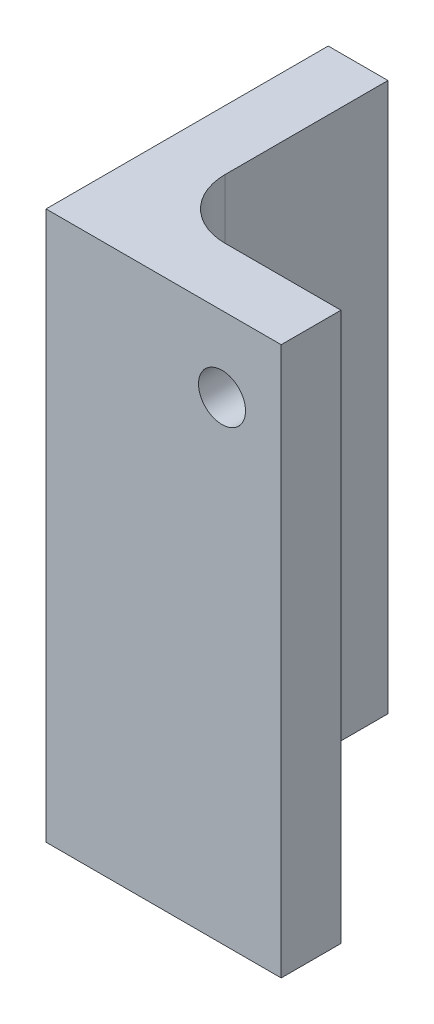
ISO-10303-21;
HEADER;
FILE_DESCRIPTION(('STEP AP214'),'2;1');
FILE_NAME('part.step','',(''),(''),'','','');
FILE_SCHEMA(('AUTOMOTIVE_DESIGN { 1 0 10303 214 1 1 1 1 }'));
ENDSEC;
DATA;
#1=APPLICATION_CONTEXT('core data for automotive mechanical design processes');
#2=APPLICATION_PROTOCOL_DEFINITION('international standard','automotive_design',2000,#1);
#3=PRODUCT_CONTEXT('',#1,'mechanical');
#4=PRODUCT('Part','Part','',(#3));
#5=PRODUCT_RELATED_PRODUCT_CATEGORY('part','',(#4));
#6=PRODUCT_DEFINITION_FORMATION('','',#4);
#7=PRODUCT_DEFINITION_CONTEXT('part definition',#1,'design');
#8=PRODUCT_DEFINITION('design','',#6,#7);
#9=PRODUCT_DEFINITION_SHAPE('','',#8);
#10=(LENGTH_UNIT() NAMED_UNIT(*) SI_UNIT(.MILLI.,.METRE.));
#11=(NAMED_UNIT(*) PLANE_ANGLE_UNIT() SI_UNIT($,.RADIAN.));
#12=(NAMED_UNIT(*) SI_UNIT($,.STERADIAN.) SOLID_ANGLE_UNIT());
#13=UNCERTAINTY_MEASURE_WITH_UNIT(LENGTH_MEASURE(1.E-05),#10,'distance_accuracy_value','');
#14=(GEOMETRIC_REPRESENTATION_CONTEXT(3) GLOBAL_UNCERTAINTY_ASSIGNED_CONTEXT((#13)) GLOBAL_UNIT_ASSIGNED_CONTEXT((#10,
#11,#12)) REPRESENTATION_CONTEXT('',''));
#15=CARTESIAN_POINT('',(0.,0.,0.));
#16=DIRECTION('',(0.,0.,1.));
#17=DIRECTION('',(1.,0.,0.));
#18=AXIS2_PLACEMENT_3D('',#15,#16,#17);
#19=CARTESIAN_POINT('',(6.35,58.31,0.));
#20=DIRECTION('',(-1.,0.,0.));
#21=DIRECTION('',(0.,0.,1.));
#22=AXIS2_PLACEMENT_3D('',#19,#20,#21);
#23=PLANE('',#22);
#24=CARTESIAN_POINT('',(6.35,10.,8.65));
#25=DIRECTION('',(-1.,0.,0.));
#26=DIRECTION('',(0.,0.,1.));
#27=AXIS2_PLACEMENT_3D('',#24,#25,#26);
#28=CIRCLE('',#27,2.5);
#29=CARTESIAN_POINT('',(6.35,10.,11.15));
#30=VERTEX_POINT('',#29);
#31=EDGE_CURVE('E175',#30,#30,#28,.T.);
#32=ORIENTED_EDGE('',*,*,#31,.T.);
#33=EDGE_LOOP('',(#32));
#34=FACE_BOUND('',#33,.T.);
#35=CARTESIAN_POINT('',(6.35,30.,8.65));
#36=DIRECTION('',(-1.,0.,0.));
#37=DIRECTION('',(0.,0.,1.));
#38=AXIS2_PLACEMENT_3D('',#35,#36,#37);
#39=CIRCLE('',#38,2.5);
#40=CARTESIAN_POINT('',(6.35,30.,11.15));
#41=VERTEX_POINT('',#40);
#42=EDGE_CURVE('E170',#41,#41,#39,.T.);
#43=ORIENTED_EDGE('',*,*,#42,.T.);
#44=EDGE_LOOP('',(#43));
#45=FACE_BOUND('',#44,.T.);
#46=DIRECTION('',(0.,0.,-1.));
#47=VECTOR('',#46,1.);
#48=CARTESIAN_POINT('',(6.35,0.,0.));
#49=LINE('',#48,#47);
#50=CARTESIAN_POINT('',(6.35,0.,17.3));
#51=VERTEX_POINT('',#50);
#52=CARTESIAN_POINT('',(6.35,0.,0.));
#53=VERTEX_POINT('',#52);
#54=EDGE_CURVE('E83',#51,#53,#49,.T.);
#55=ORIENTED_EDGE('',*,*,#54,.T.);
#56=DIRECTION('',(0.,1.,0.));
#57=VECTOR('',#56,1.);
#58=CARTESIAN_POINT('',(6.35,58.31,0.));
#59=LINE('',#58,#57);
#60=CARTESIAN_POINT('',(6.35,58.31,0.));
#61=VERTEX_POINT('',#60);
#62=EDGE_CURVE('E51',#53,#61,#59,.T.);
#63=ORIENTED_EDGE('',*,*,#62,.T.);
#64=DIRECTION('',(0.,0.,-1.));
#65=VECTOR('',#64,1.);
#66=CARTESIAN_POINT('',(6.35,58.31,0.));
#67=LINE('',#66,#65);
#68=CARTESIAN_POINT('',(6.35,58.31,17.3));
#69=VERTEX_POINT('',#68);
#70=EDGE_CURVE('E43',#69,#61,#67,.T.);
#71=ORIENTED_EDGE('',*,*,#70,.F.);
#72=DIRECTION('',(0.,-1.,0.));
#73=VECTOR('',#72,1.);
#74=CARTESIAN_POINT('',(6.35,58.31,17.3));
#75=LINE('',#74,#73);
#76=EDGE_CURVE('E123',#69,#51,#75,.T.);
#77=ORIENTED_EDGE('',*,*,#76,.T.);
#78=EDGE_LOOP('',(#55,#63,#71,#77));
#79=FACE_BOUND('',#78,.T.);
#80=ADVANCED_FACE('F35',(#34,#45,#79),#23,.F.);
#81=CARTESIAN_POINT('',(0.,58.31,0.));
#82=DIRECTION('',(1.,0.,0.));
#83=DIRECTION('',(0.,0.,-1.));
#84=AXIS2_PLACEMENT_3D('',#81,#82,#83);
#85=PLANE('',#84);
#86=CARTESIAN_POINT('',(0.,10.,8.65));
#87=DIRECTION('',(-1.,0.,0.));
#88=DIRECTION('',(0.,0.,1.));
#89=AXIS2_PLACEMENT_3D('',#86,#87,#88);
#90=CIRCLE('',#89,2.5);
#91=CARTESIAN_POINT('',(0.,10.,11.15));
#92=VERTEX_POINT('',#91);
#93=EDGE_CURVE('E130',#92,#92,#90,.T.);
#94=ORIENTED_EDGE('',*,*,#93,.F.);
#95=EDGE_LOOP('',(#94));
#96=FACE_BOUND('',#95,.T.);
#97=CARTESIAN_POINT('',(0.,30.,8.65));
#98=DIRECTION('',(-1.,0.,0.));
#99=DIRECTION('',(0.,0.,1.));
#100=AXIS2_PLACEMENT_3D('',#97,#98,#99);
#101=CIRCLE('',#100,2.5);
#102=CARTESIAN_POINT('',(0.,30.,11.15));
#103=VERTEX_POINT('',#102);
#104=EDGE_CURVE('E178',#103,#103,#101,.T.);
#105=ORIENTED_EDGE('',*,*,#104,.F.);
#106=EDGE_LOOP('',(#105));
#107=FACE_BOUND('',#106,.T.);
#108=DIRECTION('',(0.,0.,1.));
#109=VECTOR('',#108,1.);
#110=CARTESIAN_POINT('',(0.,58.31,0.));
#111=LINE('',#110,#109);
#112=CARTESIAN_POINT('',(0.,58.31,0.));
#113=VERTEX_POINT('',#112);
#114=CARTESIAN_POINT('',(0.,58.31,30.));
#115=VERTEX_POINT('',#114);
#116=EDGE_CURVE('E11',#113,#115,#111,.T.);
#117=ORIENTED_EDGE('',*,*,#116,.F.);
#118=DIRECTION('',(0.,1.,0.));
#119=VECTOR('',#118,1.);
#120=CARTESIAN_POINT('',(0.,0.,0.));
#121=LINE('',#120,#119);
#122=CARTESIAN_POINT('',(0.,0.,0.));
#123=VERTEX_POINT('',#122);
#124=EDGE_CURVE('E148',#123,#113,#121,.T.);
#125=ORIENTED_EDGE('',*,*,#124,.F.);
#126=DIRECTION('',(0.,0.,1.));
#127=VECTOR('',#126,1.);
#128=CARTESIAN_POINT('',(0.,0.,0.));
#129=LINE('',#128,#127);
#130=CARTESIAN_POINT('',(0.,0.,30.));
#131=VERTEX_POINT('',#130);
#132=EDGE_CURVE('E38',#123,#131,#129,.T.);
#133=ORIENTED_EDGE('',*,*,#132,.T.);
#134=DIRECTION('',(0.,-1.,0.));
#135=VECTOR('',#134,1.);
#136=CARTESIAN_POINT('',(0.,58.31,30.));
#137=LINE('',#136,#135);
#138=EDGE_CURVE('E139',#115,#131,#137,.T.);
#139=ORIENTED_EDGE('',*,*,#138,.F.);
#140=EDGE_LOOP('',(#117,#125,#133,#139));
#141=FACE_BOUND('',#140,.T.);
#142=ADVANCED_FACE('F145',(#96,#107,#141),#85,.F.);
#143=CARTESIAN_POINT('',(12.7,58.31,-17.3));
#144=DIRECTION('',(0.,-1.,0.));
#145=DIRECTION('',(0.,0.,-1.));
#146=AXIS2_PLACEMENT_3D('',#143,#144,#145);
#147=PLANE('',#146);
#148=ORIENTED_EDGE('',*,*,#70,.T.);
#149=DIRECTION('',(1.,0.,0.));
#150=VECTOR('',#149,1.);
#151=CARTESIAN_POINT('',(25.,58.31,0.));
#152=LINE('',#151,#150);
#153=EDGE_CURVE('E157',#113,#61,#152,.T.);
#154=ORIENTED_EDGE('',*,*,#153,.F.);
#155=ORIENTED_EDGE('',*,*,#116,.T.);
#156=DIRECTION('',(-1.,0.,0.));
#157=VECTOR('',#156,1.);
#158=CARTESIAN_POINT('',(0.,58.31,30.));
#159=LINE('',#158,#157);
#160=CARTESIAN_POINT('',(25.,58.31,30.));
#161=VERTEX_POINT('',#160);
#162=EDGE_CURVE('E118',#161,#115,#159,.T.);
#163=ORIENTED_EDGE('',*,*,#162,.F.);
#164=DIRECTION('',(0.,0.,1.));
#165=VECTOR('',#164,1.);
#166=CARTESIAN_POINT('',(25.,58.31,30.));
#167=LINE('',#166,#165);
#168=CARTESIAN_POINT('',(25.,58.31,23.65));
#169=VERTEX_POINT('',#168);
#170=EDGE_CURVE('E102',#169,#161,#167,.T.);
#171=ORIENTED_EDGE('',*,*,#170,.F.);
#172=DIRECTION('',(1.,0.,0.));
#173=VECTOR('',#172,1.);
#174=CARTESIAN_POINT('',(12.7,58.31,23.65));
#175=LINE('',#174,#173);
#176=CARTESIAN_POINT('',(12.7,58.31,23.65));
#177=VERTEX_POINT('',#176);
#178=EDGE_CURVE('E115',#177,#169,#175,.T.);
#179=ORIENTED_EDGE('',*,*,#178,.F.);
#180=CARTESIAN_POINT('',(12.7,58.31,17.3));
#181=DIRECTION('',(0.,1.,0.));
#182=DIRECTION('',(0.,0.,1.));
#183=AXIS2_PLACEMENT_3D('',#180,#181,#182);
#184=CIRCLE('',#183,6.35);
#185=EDGE_CURVE('E121',#69,#177,#184,.T.);
#186=ORIENTED_EDGE('',*,*,#185,.F.);
#187=EDGE_LOOP('',(#148,#154,#155,#163,#171,#179,#186));
#188=FACE_BOUND('',#187,.T.);
#189=ADVANCED_FACE('F113',(#188),#147,.F.);
#190=CARTESIAN_POINT('',(12.7,0.,-17.3));
#191=DIRECTION('',(0.,-1.,0.));
#192=DIRECTION('',(0.,0.,-1.));
#193=AXIS2_PLACEMENT_3D('',#190,#191,#192);
#194=PLANE('',#193);
#195=DIRECTION('',(1.,0.,0.));
#196=VECTOR('',#195,1.);
#197=CARTESIAN_POINT('',(25.,0.,0.));
#198=LINE('',#197,#196);
#199=EDGE_CURVE('E159',#123,#53,#198,.T.);
#200=ORIENTED_EDGE('',*,*,#199,.T.);
#201=ORIENTED_EDGE('',*,*,#54,.F.);
#202=CARTESIAN_POINT('',(12.7,0.,17.3));
#203=DIRECTION('',(0.,1.,0.));
#204=DIRECTION('',(0.,0.,1.));
#205=AXIS2_PLACEMENT_3D('',#202,#203,#204);
#206=CIRCLE('',#205,6.35);
#207=CARTESIAN_POINT('',(12.7,0.,23.65));
#208=VERTEX_POINT('',#207);
#209=EDGE_CURVE('E134',#51,#208,#206,.T.);
#210=ORIENTED_EDGE('',*,*,#209,.T.);
#211=DIRECTION('',(1.,0.,0.));
#212=VECTOR('',#211,1.);
#213=CARTESIAN_POINT('',(12.7,0.,23.65));
#214=LINE('',#213,#212);
#215=CARTESIAN_POINT('',(25.,0.,23.65));
#216=VERTEX_POINT('',#215);
#217=EDGE_CURVE('E132',#208,#216,#214,.T.);
#218=ORIENTED_EDGE('',*,*,#217,.T.);
#219=DIRECTION('',(0.,0.,1.));
#220=VECTOR('',#219,1.);
#221=CARTESIAN_POINT('',(25.,0.,30.));
#222=LINE('',#221,#220);
#223=CARTESIAN_POINT('',(25.,0.,30.));
#224=VERTEX_POINT('',#223);
#225=EDGE_CURVE('E104',#216,#224,#222,.T.);
#226=ORIENTED_EDGE('',*,*,#225,.T.);
#227=DIRECTION('',(-1.,0.,0.));
#228=VECTOR('',#227,1.);
#229=CARTESIAN_POINT('',(0.,0.,30.));
#230=LINE('',#229,#228);
#231=EDGE_CURVE('E127',#224,#131,#230,.T.);
#232=ORIENTED_EDGE('',*,*,#231,.T.);
#233=ORIENTED_EDGE('',*,*,#132,.F.);
#234=EDGE_LOOP('',(#200,#201,#210,#218,#226,#232,#233));
#235=FACE_BOUND('',#234,.T.);
#236=ADVANCED_FACE('F152',(#235),#194,.T.);
#237=CARTESIAN_POINT('',(0.,58.31,30.));
#238=DIRECTION('',(0.,0.,1.));
#239=DIRECTION('',(1.,0.,0.));
#240=AXIS2_PLACEMENT_3D('',#237,#238,#239);
#241=PLANE('',#240);
#242=CARTESIAN_POINT('',(18.7067209617219,50.31,30.));
#243=DIRECTION('',(0.,0.,1.));
#244=DIRECTION('',(1.,0.,0.));
#245=AXIS2_PLACEMENT_3D('',#242,#243,#244);
#246=CIRCLE('',#245,2.5);
#247=CARTESIAN_POINT('',(21.2067209617219,50.31,30.));
#248=VERTEX_POINT('',#247);
#249=EDGE_CURVE('E167',#248,#248,#246,.T.);
#250=ORIENTED_EDGE('',*,*,#249,.F.);
#251=EDGE_LOOP('',(#250));
#252=FACE_BOUND('',#251,.T.);
#253=ORIENTED_EDGE('',*,*,#231,.F.);
#254=DIRECTION('',(0.,-1.,0.));
#255=VECTOR('',#254,1.);
#256=CARTESIAN_POINT('',(25.,58.31,30.));
#257=LINE('',#256,#255);
#258=EDGE_CURVE('E109',#161,#224,#257,.T.);
#259=ORIENTED_EDGE('',*,*,#258,.F.);
#260=ORIENTED_EDGE('',*,*,#162,.T.);
#261=ORIENTED_EDGE('',*,*,#138,.T.);
#262=EDGE_LOOP('',(#253,#259,#260,#261));
#263=FACE_BOUND('',#262,.T.);
#264=ADVANCED_FACE('F151',(#252,#263),#241,.T.);
#265=CARTESIAN_POINT('',(25.,58.31,30.));
#266=DIRECTION('',(1.,0.,0.));
#267=DIRECTION('',(0.,0.,-1.));
#268=AXIS2_PLACEMENT_3D('',#265,#266,#267);
#269=PLANE('',#268);
#270=ORIENTED_EDGE('',*,*,#225,.F.);
#271=DIRECTION('',(0.,-1.,0.));
#272=VECTOR('',#271,1.);
#273=CARTESIAN_POINT('',(25.,58.31,23.65));
#274=LINE('',#273,#272);
#275=EDGE_CURVE('E99',#169,#216,#274,.T.);
#276=ORIENTED_EDGE('',*,*,#275,.F.);
#277=ORIENTED_EDGE('',*,*,#170,.T.);
#278=ORIENTED_EDGE('',*,*,#258,.T.);
#279=EDGE_LOOP('',(#270,#276,#277,#278));
#280=FACE_BOUND('',#279,.T.);
#281=ADVANCED_FACE('F101',(#280),#269,.T.);
#282=CARTESIAN_POINT('',(12.7,58.31,23.65));
#283=DIRECTION('',(0.,0.,-1.));
#284=DIRECTION('',(-1.,0.,0.));
#285=AXIS2_PLACEMENT_3D('',#282,#283,#284);
#286=PLANE('',#285);
#287=CARTESIAN_POINT('',(18.7067209617219,50.31,23.65));
#288=DIRECTION('',(0.,0.,1.));
#289=DIRECTION('',(1.,0.,0.));
#290=AXIS2_PLACEMENT_3D('',#287,#288,#289);
#291=CIRCLE('',#290,2.5);
#292=CARTESIAN_POINT('',(21.2067209617219,50.31,23.65));
#293=VERTEX_POINT('',#292);
#294=EDGE_CURVE('E162',#293,#293,#291,.T.);
#295=ORIENTED_EDGE('',*,*,#294,.T.);
#296=EDGE_LOOP('',(#295));
#297=FACE_BOUND('',#296,.T.);
#298=ORIENTED_EDGE('',*,*,#217,.F.);
#299=DIRECTION('',(0.,-1.,0.));
#300=VECTOR('',#299,1.);
#301=CARTESIAN_POINT('',(12.7,58.31,23.65));
#302=LINE('',#301,#300);
#303=EDGE_CURVE('E110',#177,#208,#302,.T.);
#304=ORIENTED_EDGE('',*,*,#303,.F.);
#305=ORIENTED_EDGE('',*,*,#178,.T.);
#306=ORIENTED_EDGE('',*,*,#275,.T.);
#307=EDGE_LOOP('',(#298,#304,#305,#306));
#308=FACE_BOUND('',#307,.T.);
#309=ADVANCED_FACE('F120',(#297,#308),#286,.T.);
#310=CARTESIAN_POINT('',(12.7,58.31,17.3));
#311=DIRECTION('',(0.,-1.,0.));
#312=DIRECTION('',(0.,0.,-1.));
#313=AXIS2_PLACEMENT_3D('',#310,#311,#312);
#314=CYLINDRICAL_SURFACE('',#313,6.35);
#315=ORIENTED_EDGE('',*,*,#209,.F.);
#316=ORIENTED_EDGE('',*,*,#76,.F.);
#317=ORIENTED_EDGE('',*,*,#185,.T.);
#318=ORIENTED_EDGE('',*,*,#303,.T.);
#319=EDGE_LOOP('',(#315,#316,#317,#318));
#320=FACE_BOUND('',#319,.T.);
#321=ADVANCED_FACE('F155',(#320),#314,.F.);
#322=CARTESIAN_POINT('',(0.,30.,8.65));
#323=DIRECTION('',(1.,0.,0.));
#324=DIRECTION('',(0.,0.,-1.));
#325=AXIS2_PLACEMENT_3D('',#322,#323,#324);
#326=CYLINDRICAL_SURFACE('',#325,2.5);
#327=ORIENTED_EDGE('',*,*,#104,.T.);
#328=EDGE_LOOP('',(#327));
#329=FACE_BOUND('',#328,.T.);
#330=ORIENTED_EDGE('',*,*,#42,.F.);
#331=EDGE_LOOP('',(#330));
#332=FACE_BOUND('',#331,.T.);
#333=ADVANCED_FACE('F185',(#329,#332),#326,.F.);
#334=CARTESIAN_POINT('',(0.,10.,8.65));
#335=DIRECTION('',(1.,0.,0.));
#336=DIRECTION('',(0.,0.,-1.));
#337=AXIS2_PLACEMENT_3D('',#334,#335,#336);
#338=CYLINDRICAL_SURFACE('',#337,2.5);
#339=ORIENTED_EDGE('',*,*,#93,.T.);
#340=EDGE_LOOP('',(#339));
#341=FACE_BOUND('',#340,.T.);
#342=ORIENTED_EDGE('',*,*,#31,.F.);
#343=EDGE_LOOP('',(#342));
#344=FACE_BOUND('',#343,.T.);
#345=ADVANCED_FACE('F187',(#341,#344),#338,.F.);
#346=CARTESIAN_POINT('',(18.7067209617219,50.31,30.));
#347=DIRECTION('',(0.,0.,-1.));
#348=DIRECTION('',(-1.,0.,0.));
#349=AXIS2_PLACEMENT_3D('',#346,#347,#348);
#350=CYLINDRICAL_SURFACE('',#349,2.5);
#351=ORIENTED_EDGE('',*,*,#249,.T.);
#352=EDGE_LOOP('',(#351));
#353=FACE_BOUND('',#352,.T.);
#354=ORIENTED_EDGE('',*,*,#294,.F.);
#355=EDGE_LOOP('',(#354));
#356=FACE_BOUND('',#355,.T.);
#357=ADVANCED_FACE('F194',(#353,#356),#350,.F.);
#358=CARTESIAN_POINT('',(25.,0.,0.));
#359=DIRECTION('',(0.,0.,1.));
#360=DIRECTION('',(1.,0.,0.));
#361=AXIS2_PLACEMENT_3D('',#358,#359,#360);
#362=PLANE('',#361);
#363=ORIENTED_EDGE('',*,*,#199,.F.);
#364=ORIENTED_EDGE('',*,*,#124,.T.);
#365=ORIENTED_EDGE('',*,*,#153,.T.);
#366=ORIENTED_EDGE('',*,*,#62,.F.);
#367=EDGE_LOOP('',(#363,#364,#365,#366));
#368=FACE_BOUND('',#367,.T.);
#369=ADVANCED_FACE('F160',(#368),#362,.F.);
#370=CLOSED_SHELL('',(#80,#142,#189,#236,#264,#281,#309,#321,#333,#345,#357,#369));
#371=MANIFOLD_SOLID_BREP('B2',#370);
#372=ADVANCED_BREP_SHAPE_REPRESENTATION('',(#18,#371),#14);
#373=SHAPE_DEFINITION_REPRESENTATION(#9,#372);
ENDSEC;
END-ISO-10303-21;
